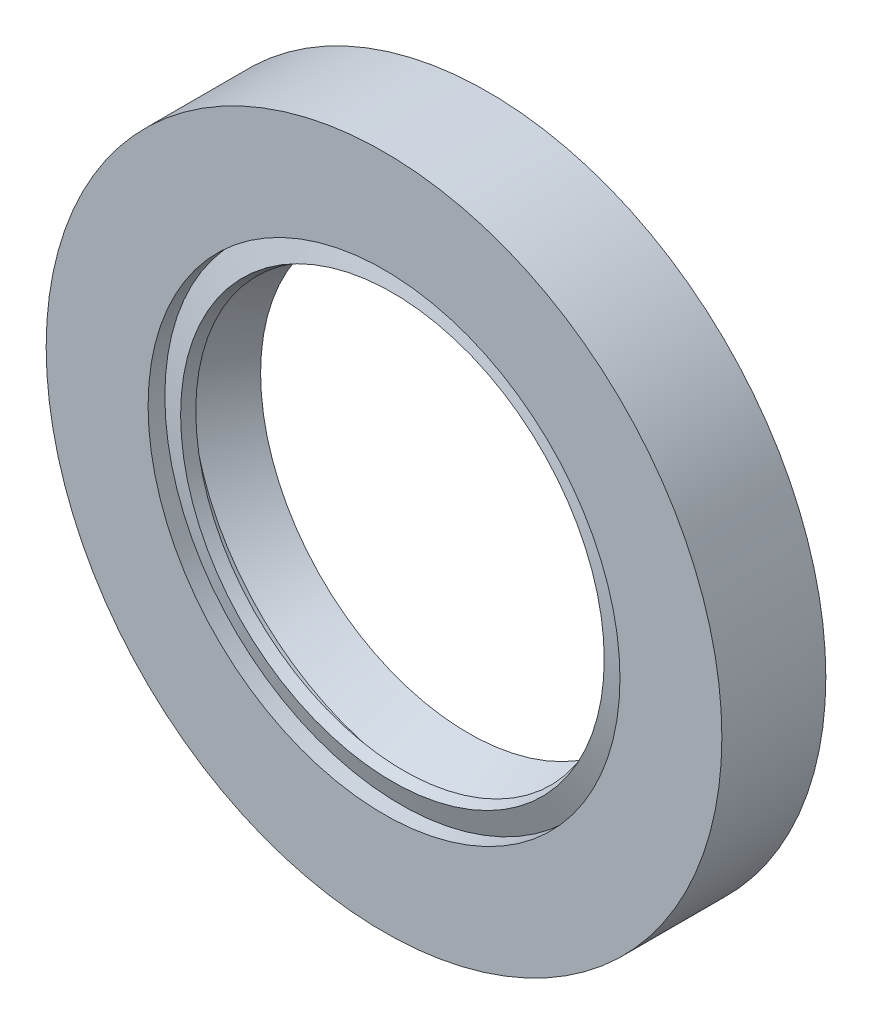
ISO-10303-21;
HEADER;
FILE_DESCRIPTION(('STEP AP214'),'2;1');
FILE_NAME('part.step','',(''),(''),'','','');
FILE_SCHEMA(('AUTOMOTIVE_DESIGN { 1 0 10303 214 1 1 1 1 }'));
ENDSEC;
DATA;
#1=APPLICATION_CONTEXT('core data for automotive mechanical design processes');
#2=APPLICATION_PROTOCOL_DEFINITION('international standard','automotive_design',2000,#1);
#3=PRODUCT_CONTEXT('',#1,'mechanical');
#4=PRODUCT('Part','Part','',(#3));
#5=PRODUCT_RELATED_PRODUCT_CATEGORY('part','',(#4));
#6=PRODUCT_DEFINITION_FORMATION('','',#4);
#7=PRODUCT_DEFINITION_CONTEXT('part definition',#1,'design');
#8=PRODUCT_DEFINITION('design','',#6,#7);
#9=PRODUCT_DEFINITION_SHAPE('','',#8);
#10=(LENGTH_UNIT() NAMED_UNIT(*) SI_UNIT(.MILLI.,.METRE.));
#11=(NAMED_UNIT(*) PLANE_ANGLE_UNIT() SI_UNIT($,.RADIAN.));
#12=(NAMED_UNIT(*) SI_UNIT($,.STERADIAN.) SOLID_ANGLE_UNIT());
#13=UNCERTAINTY_MEASURE_WITH_UNIT(LENGTH_MEASURE(1.E-05),#10,'distance_accuracy_value','');
#14=(GEOMETRIC_REPRESENTATION_CONTEXT(3) GLOBAL_UNCERTAINTY_ASSIGNED_CONTEXT((#13)) GLOBAL_UNIT_ASSIGNED_CONTEXT((#10,
#11,#12)) REPRESENTATION_CONTEXT('',''));
#15=CARTESIAN_POINT('',(0.,0.,0.));
#16=DIRECTION('',(0.,0.,1.));
#17=DIRECTION('',(1.,0.,0.));
#18=AXIS2_PLACEMENT_3D('',#15,#16,#17);
#19=CARTESIAN_POINT('',(0.,24.2944828660995,-8.));
#20=DIRECTION('',(0.,0.,1.));
#21=DIRECTION('',(1.,0.,0.));
#22=AXIS2_PLACEMENT_3D('',#19,#20,#21);
#23=PLANE('',#22);
#24=CARTESIAN_POINT('',(0.,0.,-8.));
#25=DIRECTION('',(0.,0.,1.));
#26=DIRECTION('',(1.,0.,0.));
#27=AXIS2_PLACEMENT_3D('',#24,#25,#26);
#28=CIRCLE('',#27,26.);
#29=CARTESIAN_POINT('',(26.,0.,-8.));
#30=VERTEX_POINT('',#29);
#31=EDGE_CURVE('E10',#30,#30,#28,.T.);
#32=ORIENTED_EDGE('',*,*,#31,.F.);
#33=EDGE_LOOP('',(#32));
#34=FACE_BOUND('',#33,.T.);
#35=CARTESIAN_POINT('',(0.,0.,-8.));
#36=DIRECTION('',(0.,0.,1.));
#37=DIRECTION('',(1.,0.,0.));
#38=AXIS2_PLACEMENT_3D('',#35,#36,#37);
#39=CIRCLE('',#38,24.2944828660995);
#40=CARTESIAN_POINT('',(24.2944828660995,0.,-8.));
#41=VERTEX_POINT('',#40);
#42=EDGE_CURVE('E76',#41,#41,#39,.T.);
#43=ORIENTED_EDGE('',*,*,#42,.T.);
#44=EDGE_LOOP('',(#43));
#45=FACE_BOUND('',#44,.T.);
#46=ADVANCED_FACE('F30',(#34,#45),#23,.F.);
#47=CARTESIAN_POINT('',(0.,0.,0.));
#48=DIRECTION('',(0.,0.,1.));
#49=DIRECTION('',(1.,0.,0.));
#50=AXIS2_PLACEMENT_3D('',#47,#48,#49);
#51=CYLINDRICAL_SURFACE('',#50,26.);
#52=CARTESIAN_POINT('',(0.,0.,0.));
#53=DIRECTION('',(0.,0.,1.));
#54=DIRECTION('',(1.,0.,0.));
#55=AXIS2_PLACEMENT_3D('',#52,#53,#54);
#56=CIRCLE('',#55,26.);
#57=CARTESIAN_POINT('',(26.,0.,0.));
#58=VERTEX_POINT('',#57);
#59=EDGE_CURVE('E36',#58,#58,#56,.T.);
#60=ORIENTED_EDGE('',*,*,#59,.F.);
#61=EDGE_LOOP('',(#60));
#62=FACE_BOUND('',#61,.T.);
#63=ORIENTED_EDGE('',*,*,#31,.T.);
#64=EDGE_LOOP('',(#63));
#65=FACE_BOUND('',#64,.T.);
#66=ADVANCED_FACE('F149',(#62,#65),#51,.T.);
#67=CARTESIAN_POINT('',(0.,26.,0.));
#68=DIRECTION('',(0.,0.,-1.));
#69=DIRECTION('',(-1.,0.,0.));
#70=AXIS2_PLACEMENT_3D('',#67,#68,#69);
#71=PLANE('',#70);
#72=CARTESIAN_POINT('',(0.,0.,0.));
#73=DIRECTION('',(0.,0.,1.));
#74=DIRECTION('',(1.,0.,0.));
#75=AXIS2_PLACEMENT_3D('',#72,#73,#74);
#76=CIRCLE('',#75,18.1570770960964);
#77=CARTESIAN_POINT('',(18.1570770960964,0.,0.));
#78=VERTEX_POINT('',#77);
#79=EDGE_CURVE('E40',#78,#78,#76,.T.);
#80=ORIENTED_EDGE('',*,*,#79,.F.);
#81=EDGE_LOOP('',(#80));
#82=FACE_BOUND('',#81,.T.);
#83=ORIENTED_EDGE('',*,*,#59,.T.);
#84=EDGE_LOOP('',(#83));
#85=FACE_BOUND('',#84,.T.);
#86=ADVANCED_FACE('F144',(#82,#85),#71,.F.);
#87=CARTESIAN_POINT('',(0.,0.,0.));
#88=DIRECTION('',(0.,0.,1.));
#89=DIRECTION('',(1.,0.,0.));
#90=AXIS2_PLACEMENT_3D('',#87,#88,#89);
#91=CYLINDRICAL_SURFACE('',#90,18.1570770960964);
#92=CARTESIAN_POINT('',(0.,0.,-1.28990535919606));
#93=DIRECTION('',(0.,0.,1.));
#94=DIRECTION('',(1.,0.,0.));
#95=AXIS2_PLACEMENT_3D('',#92,#93,#94);
#96=CIRCLE('',#95,18.1570770960964);
#97=CARTESIAN_POINT('',(18.1570770960964,0.,-1.28990535919606));
#98=VERTEX_POINT('',#97);
#99=EDGE_CURVE('E44',#98,#98,#96,.T.);
#100=ORIENTED_EDGE('',*,*,#99,.F.);
#101=EDGE_LOOP('',(#100));
#102=FACE_BOUND('',#101,.T.);
#103=ORIENTED_EDGE('',*,*,#79,.T.);
#104=EDGE_LOOP('',(#103));
#105=FACE_BOUND('',#104,.T.);
#106=ADVANCED_FACE('F138',(#102,#105),#91,.F.);
#107=CARTESIAN_POINT('',(0.,0.,-1.28990535919606));
#108=DIRECTION('',(0.,0.,-1.));
#109=DIRECTION('',(-1.,0.,0.));
#110=AXIS2_PLACEMENT_3D('',#107,#108,#109);
#111=CONICAL_SURFACE('',#110,18.1570770960964,1.23729560827876);
#112=CARTESIAN_POINT('',(0.,0.,-0.646560904182751));
#113=DIRECTION('',(0.,0.,1.));
#114=DIRECTION('',(1.,0.,0.));
#115=AXIS2_PLACEMENT_3D('',#112,#113,#114);
#116=CIRCLE('',#115,16.3000670143998);
#117=CARTESIAN_POINT('',(16.3000670143998,0.,-0.646560904182751));
#118=VERTEX_POINT('',#117);
#119=EDGE_CURVE('E49',#118,#118,#116,.T.);
#120=ORIENTED_EDGE('',*,*,#119,.F.);
#121=EDGE_LOOP('',(#120));
#122=FACE_BOUND('',#121,.T.);
#123=ORIENTED_EDGE('',*,*,#99,.T.);
#124=EDGE_LOOP('',(#123));
#125=FACE_BOUND('',#124,.T.);
#126=ADVANCED_FACE('F132',(#122,#125),#111,.T.);
#127=CARTESIAN_POINT('',(0.,0.,-0.646560904182751));
#128=DIRECTION('',(0.,0.,1.));
#129=DIRECTION('',(1.,0.,0.));
#130=AXIS2_PLACEMENT_3D('',#127,#128,#129);
#131=CONICAL_SURFACE('',#130,16.3000670143998,0.333500718516137);
#132=CARTESIAN_POINT('',(0.,0.,-1.51270262124093));
#133=DIRECTION('',(0.,0.,1.));
#134=DIRECTION('',(1.,0.,0.));
#135=AXIS2_PLACEMENT_3D('',#132,#133,#134);
#136=CIRCLE('',#135,16.);
#137=CARTESIAN_POINT('',(16.,0.,-1.51270262124093));
#138=VERTEX_POINT('',#137);
#139=EDGE_CURVE('E52',#138,#138,#136,.T.);
#140=ORIENTED_EDGE('',*,*,#139,.F.);
#141=EDGE_LOOP('',(#140));
#142=FACE_BOUND('',#141,.T.);
#143=ORIENTED_EDGE('',*,*,#119,.T.);
#144=EDGE_LOOP('',(#143));
#145=FACE_BOUND('',#144,.T.);
#146=ADVANCED_FACE('F126',(#142,#145),#131,.F.);
#147=CARTESIAN_POINT('',(0.,0.,-1.51270262124093));
#148=DIRECTION('',(0.,0.,-1.));
#149=DIRECTION('',(-1.,0.,0.));
#150=AXIS2_PLACEMENT_3D('',#147,#148,#149);
#151=CONICAL_SURFACE('',#150,16.,1.23729560827876);
#152=CARTESIAN_POINT('',(0.,0.,-2.24065457623389));
#153=DIRECTION('',(0.,0.,1.));
#154=DIRECTION('',(1.,0.,0.));
#155=AXIS2_PLACEMENT_3D('',#152,#153,#154);
#156=CIRCLE('',#155,18.1012291454112);
#157=CARTESIAN_POINT('',(18.1012291454112,0.,-2.24065457623389));
#158=VERTEX_POINT('',#157);
#159=EDGE_CURVE('E55',#158,#158,#156,.T.);
#160=ORIENTED_EDGE('',*,*,#159,.F.);
#161=EDGE_LOOP('',(#160));
#162=FACE_BOUND('',#161,.T.);
#163=ORIENTED_EDGE('',*,*,#139,.T.);
#164=EDGE_LOOP('',(#163));
#165=FACE_BOUND('',#164,.T.);
#166=ADVANCED_FACE('F120',(#162,#165),#151,.F.);
#167=CARTESIAN_POINT('',(0.,0.,0.));
#168=DIRECTION('',(0.,0.,1.));
#169=DIRECTION('',(1.,0.,0.));
#170=AXIS2_PLACEMENT_3D('',#167,#168,#169);
#171=CYLINDRICAL_SURFACE('',#170,18.1012291454112);
#172=CARTESIAN_POINT('',(0.,0.,-3.26716899412793));
#173=DIRECTION('',(0.,0.,1.));
#174=DIRECTION('',(1.,0.,0.));
#175=AXIS2_PLACEMENT_3D('',#172,#173,#174);
#176=CIRCLE('',#175,18.1012291454112);
#177=CARTESIAN_POINT('',(18.1012291454112,0.,-3.26716899412793));
#178=VERTEX_POINT('',#177);
#179=EDGE_CURVE('E58',#178,#178,#176,.T.);
#180=ORIENTED_EDGE('',*,*,#179,.F.);
#181=EDGE_LOOP('',(#180));
#182=FACE_BOUND('',#181,.T.);
#183=ORIENTED_EDGE('',*,*,#159,.T.);
#184=EDGE_LOOP('',(#183));
#185=FACE_BOUND('',#184,.T.);
#186=ADVANCED_FACE('F114',(#182,#185),#171,.F.);
#187=CARTESIAN_POINT('',(0.,0.,-3.26716899412793));
#188=DIRECTION('',(0.,0.,1.));
#189=DIRECTION('',(1.,0.,0.));
#190=AXIS2_PLACEMENT_3D('',#187,#188,#189);
#191=CONICAL_SURFACE('',#190,18.1012291454112,0.576102799671608);
#192=CARTESIAN_POINT('',(0.,0.,-6.50175728207016));
#193=DIRECTION('',(0.,0.,1.));
#194=DIRECTION('',(1.,0.,0.));
#195=AXIS2_PLACEMENT_3D('',#192,#193,#194);
#196=CIRCLE('',#195,16.);
#197=CARTESIAN_POINT('',(16.,0.,-6.50175728207016));
#198=VERTEX_POINT('',#197);
#199=EDGE_CURVE('E61',#198,#198,#196,.T.);
#200=ORIENTED_EDGE('',*,*,#199,.F.);
#201=EDGE_LOOP('',(#200));
#202=FACE_BOUND('',#201,.T.);
#203=ORIENTED_EDGE('',*,*,#179,.T.);
#204=EDGE_LOOP('',(#203));
#205=FACE_BOUND('',#204,.T.);
#206=ADVANCED_FACE('F108',(#202,#205),#191,.F.);
#207=CARTESIAN_POINT('',(0.,0.,-6.50175728207016));
#208=DIRECTION('',(0.,0.,-1.));
#209=DIRECTION('',(-1.,0.,0.));
#210=AXIS2_PLACEMENT_3D('',#207,#208,#209);
#211=CONICAL_SURFACE('',#210,16.,1.05815008396677);
#212=CARTESIAN_POINT('',(0.,0.,-7.71911999242032));
#213=DIRECTION('',(0.,0.,1.));
#214=DIRECTION('',(1.,0.,0.));
#215=AXIS2_PLACEMENT_3D('',#212,#213,#214);
#216=CIRCLE('',#215,18.1629004075565);
#217=CARTESIAN_POINT('',(18.1629004075565,0.,-7.71911999242032));
#218=VERTEX_POINT('',#217);
#219=EDGE_CURVE('E64',#218,#218,#216,.T.);
#220=ORIENTED_EDGE('',*,*,#219,.F.);
#221=EDGE_LOOP('',(#220));
#222=FACE_BOUND('',#221,.T.);
#223=ORIENTED_EDGE('',*,*,#199,.T.);
#224=EDGE_LOOP('',(#223));
#225=FACE_BOUND('',#224,.T.);
#226=ADVANCED_FACE('F102',(#222,#225),#211,.F.);
#227=CARTESIAN_POINT('',(0.,18.1629004075565,-7.71911999242032));
#228=DIRECTION('',(0.,0.,1.));
#229=DIRECTION('',(1.,0.,0.));
#230=AXIS2_PLACEMENT_3D('',#227,#228,#229);
#231=PLANE('',#230);
#232=CARTESIAN_POINT('',(0.,0.,-7.71911999242032));
#233=DIRECTION('',(0.,0.,1.));
#234=DIRECTION('',(1.,0.,0.));
#235=AXIS2_PLACEMENT_3D('',#232,#233,#234);
#236=CIRCLE('',#235,19.2561311684476);
#237=CARTESIAN_POINT('',(19.2561311684476,0.,-7.71911999242032));
#238=VERTEX_POINT('',#237);
#239=EDGE_CURVE('E67',#238,#238,#236,.T.);
#240=ORIENTED_EDGE('',*,*,#239,.F.);
#241=EDGE_LOOP('',(#240));
#242=FACE_BOUND('',#241,.T.);
#243=ORIENTED_EDGE('',*,*,#219,.T.);
#244=EDGE_LOOP('',(#243));
#245=FACE_BOUND('',#244,.T.);
#246=ADVANCED_FACE('F96',(#242,#245),#231,.F.);
#247=CARTESIAN_POINT('',(0.,0.,0.));
#248=DIRECTION('',(0.,0.,1.));
#249=DIRECTION('',(1.,0.,0.));
#250=AXIS2_PLACEMENT_3D('',#247,#248,#249);
#251=CYLINDRICAL_SURFACE('',#250,19.2561311684476);
#252=CARTESIAN_POINT('',(0.,0.,-1.47017550082669));
#253=DIRECTION('',(0.,0.,1.));
#254=DIRECTION('',(1.,0.,0.));
#255=AXIS2_PLACEMENT_3D('',#252,#253,#254);
#256=CIRCLE('',#255,19.2561311684476);
#257=CARTESIAN_POINT('',(19.2561311684476,0.,-1.47017550082669));
#258=VERTEX_POINT('',#257);
#259=EDGE_CURVE('E70',#258,#258,#256,.T.);
#260=ORIENTED_EDGE('',*,*,#259,.F.);
#261=EDGE_LOOP('',(#260));
#262=FACE_BOUND('',#261,.T.);
#263=ORIENTED_EDGE('',*,*,#239,.T.);
#264=EDGE_LOOP('',(#263));
#265=FACE_BOUND('',#264,.T.);
#266=ADVANCED_FACE('F90',(#262,#265),#251,.T.);
#267=CARTESIAN_POINT('',(0.,19.2561311684476,-1.47017550082669));
#268=DIRECTION('',(0.,0.,1.));
#269=DIRECTION('',(1.,0.,0.));
#270=AXIS2_PLACEMENT_3D('',#267,#268,#269);
#271=PLANE('',#270);
#272=CARTESIAN_POINT('',(0.,0.,-1.47017550082669));
#273=DIRECTION('',(0.,0.,1.));
#274=DIRECTION('',(1.,0.,0.));
#275=AXIS2_PLACEMENT_3D('',#272,#273,#274);
#276=CIRCLE('',#275,24.2944828660995);
#277=CARTESIAN_POINT('',(24.2944828660995,0.,-1.47017550082669));
#278=VERTEX_POINT('',#277);
#279=EDGE_CURVE('E73',#278,#278,#276,.T.);
#280=ORIENTED_EDGE('',*,*,#279,.F.);
#281=EDGE_LOOP('',(#280));
#282=FACE_BOUND('',#281,.T.);
#283=ORIENTED_EDGE('',*,*,#259,.T.);
#284=EDGE_LOOP('',(#283));
#285=FACE_BOUND('',#284,.T.);
#286=ADVANCED_FACE('F84',(#282,#285),#271,.F.);
#287=CARTESIAN_POINT('',(0.,0.,0.));
#288=DIRECTION('',(0.,0.,1.));
#289=DIRECTION('',(1.,0.,0.));
#290=AXIS2_PLACEMENT_3D('',#287,#288,#289);
#291=CYLINDRICAL_SURFACE('',#290,24.2944828660995);
#292=ORIENTED_EDGE('',*,*,#42,.F.);
#293=EDGE_LOOP('',(#292));
#294=FACE_BOUND('',#293,.T.);
#295=ORIENTED_EDGE('',*,*,#279,.T.);
#296=EDGE_LOOP('',(#295));
#297=FACE_BOUND('',#296,.T.);
#298=ADVANCED_FACE('F81',(#294,#297),#291,.F.);
#299=CLOSED_SHELL('',(#46,#66,#86,#106,#126,#146,#166,#186,#206,#226,#246,#266,#286,#298));
#300=MANIFOLD_SOLID_BREP('B2',#299);
#301=ADVANCED_BREP_SHAPE_REPRESENTATION('',(#18,#300),#14);
#302=SHAPE_DEFINITION_REPRESENTATION(#9,#301);
ENDSEC;
END-ISO-10303-21;
